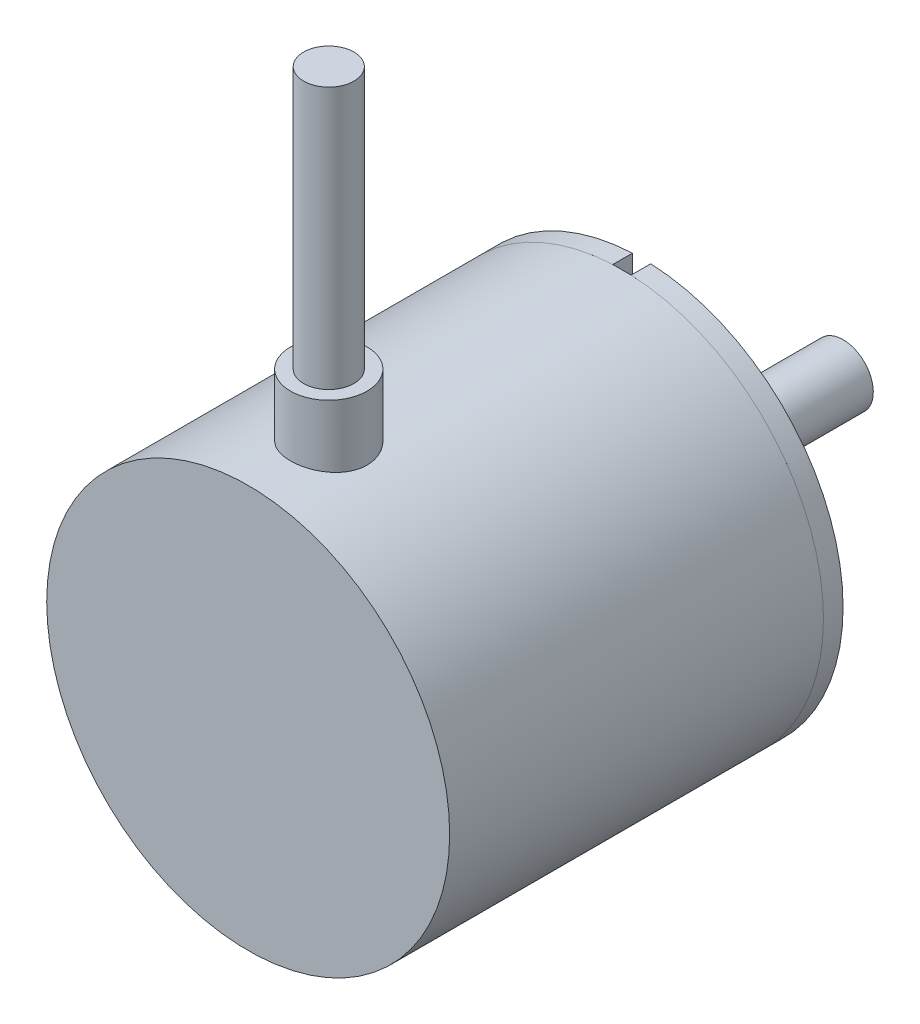
ISO-10303-21;
HEADER;
FILE_DESCRIPTION(('STEP AP214'),'2;1');
FILE_NAME('part.step','',(''),(''),'','','');
FILE_SCHEMA(('AUTOMOTIVE_DESIGN { 1 0 10303 214 1 1 1 1 }'));
ENDSEC;
DATA;
#1=APPLICATION_CONTEXT('core data for automotive mechanical design processes');
#2=APPLICATION_PROTOCOL_DEFINITION('international standard','automotive_design',2000,#1);
#3=PRODUCT_CONTEXT('',#1,'mechanical');
#4=PRODUCT('Part','Part','',(#3));
#5=PRODUCT_RELATED_PRODUCT_CATEGORY('part','',(#4));
#6=PRODUCT_DEFINITION_FORMATION('','',#4);
#7=PRODUCT_DEFINITION_CONTEXT('part definition',#1,'design');
#8=PRODUCT_DEFINITION('design','',#6,#7);
#9=PRODUCT_DEFINITION_SHAPE('','',#8);
#10=(LENGTH_UNIT() NAMED_UNIT(*) SI_UNIT(.MILLI.,.METRE.));
#11=(NAMED_UNIT(*) PLANE_ANGLE_UNIT() SI_UNIT($,.RADIAN.));
#12=(NAMED_UNIT(*) SI_UNIT($,.STERADIAN.) SOLID_ANGLE_UNIT());
#13=UNCERTAINTY_MEASURE_WITH_UNIT(LENGTH_MEASURE(1.E-05),#10,'distance_accuracy_value','');
#14=(GEOMETRIC_REPRESENTATION_CONTEXT(3) GLOBAL_UNCERTAINTY_ASSIGNED_CONTEXT((#13)) GLOBAL_UNIT_ASSIGNED_CONTEXT((#10,
#11,#12)) REPRESENTATION_CONTEXT('',''));
#15=CARTESIAN_POINT('',(0.,0.,0.));
#16=DIRECTION('',(0.,0.,1.));
#17=DIRECTION('',(1.,0.,0.));
#18=AXIS2_PLACEMENT_3D('',#15,#16,#17);
#19=CARTESIAN_POINT('',(0.,0.,0.));
#20=DIRECTION('',(0.,0.,1.));
#21=DIRECTION('',(1.,0.,0.));
#22=AXIS2_PLACEMENT_3D('',#19,#20,#21);
#23=PLANE('',#22);
#24=CARTESIAN_POINT('',(0.,0.,0.));
#25=DIRECTION('',(0.,0.,1.));
#26=DIRECTION('',(1.,0.,0.));
#27=AXIS2_PLACEMENT_3D('',#24,#25,#26);
#28=CIRCLE('',#27,10.);
#29=CARTESIAN_POINT('',(10.,0.,0.));
#30=VERTEX_POINT('',#29);
#31=EDGE_CURVE('E140',#30,#30,#28,.F.);
#32=ORIENTED_EDGE('',*,*,#31,.F.);
#33=EDGE_LOOP('',(#32));
#34=FACE_BOUND('',#33,.T.);
#35=CARTESIAN_POINT('',(0.,15.,0.));
#36=DIRECTION('',(0.,0.,-1.));
#37=DIRECTION('',(-1.,0.,0.));
#38=AXIS2_PLACEMENT_3D('',#35,#36,#37);
#39=CIRCLE('',#38,1.00000000000079);
#40=CARTESIAN_POINT('',(-1.00000000000079,15.,0.));
#41=VERTEX_POINT('',#40);
#42=EDGE_CURVE('E154',#41,#41,#39,.T.);
#43=ORIENTED_EDGE('',*,*,#42,.F.);
#44=EDGE_LOOP('',(#43));
#45=FACE_BOUND('',#44,.T.);
#46=CARTESIAN_POINT('',(-12.9903810567675,-7.49999999999947,0.));
#47=DIRECTION('',(0.,0.,-1.));
#48=DIRECTION('',(-1.,0.,0.));
#49=AXIS2_PLACEMENT_3D('',#46,#47,#48);
#50=CIRCLE('',#49,1.00000000000079);
#51=CARTESIAN_POINT('',(-13.9903810567683,-7.49999999999947,0.));
#52=VERTEX_POINT('',#51);
#53=EDGE_CURVE('E159',#52,#52,#50,.T.);
#54=ORIENTED_EDGE('',*,*,#53,.F.);
#55=EDGE_LOOP('',(#54));
#56=FACE_BOUND('',#55,.T.);
#57=CARTESIAN_POINT('',(12.9903810567657,-7.50000000000052,0.));
#58=DIRECTION('',(0.,0.,-1.));
#59=DIRECTION('',(-1.,0.,0.));
#60=AXIS2_PLACEMENT_3D('',#57,#58,#59);
#61=CIRCLE('',#60,1.00000000000079);
#62=CARTESIAN_POINT('',(11.9903810567649,-7.50000000000052,0.));
#63=VERTEX_POINT('',#62);
#64=EDGE_CURVE('E163',#63,#63,#61,.T.);
#65=ORIENTED_EDGE('',*,*,#64,.F.);
#66=EDGE_LOOP('',(#65));
#67=FACE_BOUND('',#66,.T.);
#68=DIRECTION('',(0.,-1.,0.));
#69=VECTOR('',#68,1.);
#70=CARTESIAN_POINT('',(-0.91,0.,0.));
#71=LINE('',#70,#69);
#72=CARTESIAN_POINT('',(-0.91,19.9792867740568,0.));
#73=VERTEX_POINT('',#72);
#74=CARTESIAN_POINT('',(-0.91,18.0794623505173,0.));
#75=VERTEX_POINT('',#74);
#76=EDGE_CURVE('E109',#73,#75,#71,.T.);
#77=ORIENTED_EDGE('',*,*,#76,.T.);
#78=DIRECTION('',(-1.,0.,0.));
#79=VECTOR('',#78,1.);
#80=CARTESIAN_POINT('',(0.,18.0794623505173,0.));
#81=LINE('',#80,#79);
#82=CARTESIAN_POINT('',(0.91,18.0794623505173,0.));
#83=VERTEX_POINT('',#82);
#84=EDGE_CURVE('E91',#83,#75,#81,.T.);
#85=ORIENTED_EDGE('',*,*,#84,.F.);
#86=DIRECTION('',(0.,-1.,0.));
#87=VECTOR('',#86,1.);
#88=CARTESIAN_POINT('',(0.91,0.,0.));
#89=LINE('',#88,#87);
#90=CARTESIAN_POINT('',(0.91,19.9792867740568,0.));
#91=VERTEX_POINT('',#90);
#92=EDGE_CURVE('E99',#91,#83,#89,.T.);
#93=ORIENTED_EDGE('',*,*,#92,.F.);
#94=CARTESIAN_POINT('',(0.,0.,0.));
#95=DIRECTION('',(0.,0.,1.));
#96=DIRECTION('',(1.,0.,0.));
#97=AXIS2_PLACEMENT_3D('',#94,#95,#96);
#98=CIRCLE('',#97,20.);
#99=EDGE_CURVE('E170',#73,#91,#98,.T.);
#100=ORIENTED_EDGE('',*,*,#99,.F.);
#101=EDGE_LOOP('',(#77,#85,#93,#100));
#102=FACE_BOUND('',#101,.T.);
#103=ADVANCED_FACE('F52',(#34,#45,#56,#67,#102),#23,.F.);
#104=CARTESIAN_POINT('',(0.,0.,1.95));
#105=DIRECTION('',(0.,0.,-1.));
#106=DIRECTION('',(-1.,0.,0.));
#107=AXIS2_PLACEMENT_3D('',#104,#105,#106);
#108=CYLINDRICAL_SURFACE('',#107,20.);
#109=DIRECTION('',(0.,0.,-1.));
#110=VECTOR('',#109,1.);
#111=CARTESIAN_POINT('',(-0.91,19.9792867740568,2.3));
#112=LINE('',#111,#110);
#113=CARTESIAN_POINT('',(-0.91,19.9792867740568,1.95));
#114=VERTEX_POINT('',#113);
#115=EDGE_CURVE('E121',#114,#73,#112,.T.);
#116=ORIENTED_EDGE('',*,*,#115,.T.);
#117=ORIENTED_EDGE('',*,*,#99,.T.);
#118=DIRECTION('',(0.,0.,-1.));
#119=VECTOR('',#118,1.);
#120=CARTESIAN_POINT('',(0.91,19.9792867740568,2.3));
#121=LINE('',#120,#119);
#122=CARTESIAN_POINT('',(0.91,19.9792867740568,1.95));
#123=VERTEX_POINT('',#122);
#124=EDGE_CURVE('E102',#123,#91,#121,.T.);
#125=ORIENTED_EDGE('',*,*,#124,.F.);
#126=CARTESIAN_POINT('',(0.,0.,1.95));
#127=DIRECTION('',(0.,0.,1.));
#128=DIRECTION('',(1.,0.,0.));
#129=AXIS2_PLACEMENT_3D('',#126,#127,#128);
#130=CIRCLE('',#129,20.);
#131=EDGE_CURVE('E141',#114,#123,#130,.T.);
#132=ORIENTED_EDGE('',*,*,#131,.F.);
#133=EDGE_LOOP('',(#116,#117,#125,#132));
#134=FACE_BOUND('',#133,.T.);
#135=ADVANCED_FACE('F192',(#134),#108,.T.);
#136=CARTESIAN_POINT('',(0.,0.,1.95));
#137=DIRECTION('',(0.,0.,1.));
#138=DIRECTION('',(1.,0.,0.));
#139=AXIS2_PLACEMENT_3D('',#136,#137,#138);
#140=PLANE('',#139);
#141=CARTESIAN_POINT('',(0.,15.,1.95));
#142=DIRECTION('',(0.,0.,1.));
#143=DIRECTION('',(1.,0.,0.));
#144=AXIS2_PLACEMENT_3D('',#141,#142,#143);
#145=CIRCLE('',#144,1.00000000000079);
#146=CARTESIAN_POINT('',(1.00000000000079,15.,1.95));
#147=VERTEX_POINT('',#146);
#148=EDGE_CURVE('E146',#147,#147,#145,.T.);
#149=ORIENTED_EDGE('',*,*,#148,.F.);
#150=EDGE_LOOP('',(#149));
#151=FACE_BOUND('',#150,.T.);
#152=CARTESIAN_POINT('',(-12.9903810567675,-7.49999999999947,1.95));
#153=DIRECTION('',(0.,0.,1.));
#154=DIRECTION('',(1.,0.,0.));
#155=AXIS2_PLACEMENT_3D('',#152,#153,#154);
#156=CIRCLE('',#155,1.00000000000079);
#157=CARTESIAN_POINT('',(-11.9903810567667,-7.49999999999947,1.95));
#158=VERTEX_POINT('',#157);
#159=EDGE_CURVE('E158',#158,#158,#156,.T.);
#160=ORIENTED_EDGE('',*,*,#159,.F.);
#161=EDGE_LOOP('',(#160));
#162=FACE_BOUND('',#161,.T.);
#163=CARTESIAN_POINT('',(12.9903810567657,-7.50000000000052,1.95));
#164=DIRECTION('',(0.,0.,1.));
#165=DIRECTION('',(1.,0.,0.));
#166=AXIS2_PLACEMENT_3D('',#163,#164,#165);
#167=CIRCLE('',#166,1.00000000000079);
#168=CARTESIAN_POINT('',(13.9903810567665,-7.50000000000052,1.95));
#169=VERTEX_POINT('',#168);
#170=EDGE_CURVE('E162',#169,#169,#167,.T.);
#171=ORIENTED_EDGE('',*,*,#170,.F.);
#172=EDGE_LOOP('',(#171));
#173=FACE_BOUND('',#172,.T.);
#174=DIRECTION('',(1.,0.,0.));
#175=VECTOR('',#174,1.);
#176=CARTESIAN_POINT('',(0.,18.0794623505173,1.95));
#177=LINE('',#176,#175);
#178=CARTESIAN_POINT('',(-0.91,18.0794623505173,1.95));
#179=VERTEX_POINT('',#178);
#180=CARTESIAN_POINT('',(0.91,18.0794623505173,1.95));
#181=VERTEX_POINT('',#180);
#182=EDGE_CURVE('E94',#179,#181,#177,.T.);
#183=ORIENTED_EDGE('',*,*,#182,.F.);
#184=DIRECTION('',(0.,1.,0.));
#185=VECTOR('',#184,1.);
#186=CARTESIAN_POINT('',(-0.91,0.,1.95));
#187=LINE('',#186,#185);
#188=EDGE_CURVE('E150',#179,#114,#187,.T.);
#189=ORIENTED_EDGE('',*,*,#188,.T.);
#190=ORIENTED_EDGE('',*,*,#131,.T.);
#191=DIRECTION('',(0.,1.,0.));
#192=VECTOR('',#191,1.);
#193=CARTESIAN_POINT('',(0.91,0.,1.95));
#194=LINE('',#193,#192);
#195=EDGE_CURVE('E111',#181,#123,#194,.T.);
#196=ORIENTED_EDGE('',*,*,#195,.F.);
#197=EDGE_LOOP('',(#183,#189,#190,#196));
#198=FACE_BOUND('',#197,.T.);
#199=ADVANCED_FACE('F133',(#151,#162,#173,#198),#140,.T.);
#200=CARTESIAN_POINT('',(0.,0.,-5.));
#201=DIRECTION('',(0.,0.,-1.));
#202=DIRECTION('',(-1.,0.,0.));
#203=AXIS2_PLACEMENT_3D('',#200,#201,#202);
#204=PLANE('',#203);
#205=CARTESIAN_POINT('',(0.,0.,-5.));
#206=DIRECTION('',(0.,0.,-1.));
#207=DIRECTION('',(-1.,0.,0.));
#208=AXIS2_PLACEMENT_3D('',#205,#206,#207);
#209=CIRCLE('',#208,7.5);
#210=CARTESIAN_POINT('',(-7.5,0.,-5.));
#211=VERTEX_POINT('',#210);
#212=EDGE_CURVE('E62',#211,#211,#209,.T.);
#213=ORIENTED_EDGE('',*,*,#212,.F.);
#214=EDGE_LOOP('',(#213));
#215=FACE_BOUND('',#214,.T.);
#216=CARTESIAN_POINT('',(0.,0.,-5.));
#217=DIRECTION('',(0.,0.,-1.));
#218=DIRECTION('',(-1.,0.,0.));
#219=AXIS2_PLACEMENT_3D('',#216,#217,#218);
#220=CIRCLE('',#219,10.);
#221=CARTESIAN_POINT('',(-10.,0.,-5.));
#222=VERTEX_POINT('',#221);
#223=EDGE_CURVE('E137',#222,#222,#220,.T.);
#224=ORIENTED_EDGE('',*,*,#223,.T.);
#225=EDGE_LOOP('',(#224));
#226=FACE_BOUND('',#225,.T.);
#227=ADVANCED_FACE('F129',(#215,#226),#204,.T.);
#228=CARTESIAN_POINT('',(0.,0.,-5.));
#229=DIRECTION('',(0.,0.,1.));
#230=DIRECTION('',(1.,0.,0.));
#231=AXIS2_PLACEMENT_3D('',#228,#229,#230);
#232=CYLINDRICAL_SURFACE('',#231,10.);
#233=ORIENTED_EDGE('',*,*,#223,.F.);
#234=EDGE_LOOP('',(#233));
#235=FACE_BOUND('',#234,.T.);
#236=ORIENTED_EDGE('',*,*,#31,.T.);
#237=EDGE_LOOP('',(#236));
#238=FACE_BOUND('',#237,.T.);
#239=ADVANCED_FACE('F132',(#235,#238),#232,.T.);
#240=CARTESIAN_POINT('',(0.,15.,10.));
#241=DIRECTION('',(0.,0.,-1.));
#242=DIRECTION('',(-1.,0.,0.));
#243=AXIS2_PLACEMENT_3D('',#240,#241,#242);
#244=CYLINDRICAL_SURFACE('',#243,1.00000000000079);
#245=ORIENTED_EDGE('',*,*,#148,.T.);
#246=EDGE_LOOP('',(#245));
#247=FACE_BOUND('',#246,.T.);
#248=ORIENTED_EDGE('',*,*,#42,.T.);
#249=EDGE_LOOP('',(#248));
#250=FACE_BOUND('',#249,.T.);
#251=ADVANCED_FACE('F205',(#247,#250),#244,.F.);
#252=CARTESIAN_POINT('',(-12.9903810567675,-7.49999999999947,10.));
#253=DIRECTION('',(0.,0.,-1.));
#254=DIRECTION('',(-1.,0.,0.));
#255=AXIS2_PLACEMENT_3D('',#252,#253,#254);
#256=CYLINDRICAL_SURFACE('',#255,1.00000000000079);
#257=ORIENTED_EDGE('',*,*,#159,.T.);
#258=EDGE_LOOP('',(#257));
#259=FACE_BOUND('',#258,.T.);
#260=ORIENTED_EDGE('',*,*,#53,.T.);
#261=EDGE_LOOP('',(#260));
#262=FACE_BOUND('',#261,.T.);
#263=ADVANCED_FACE('F209',(#259,#262),#256,.F.);
#264=CARTESIAN_POINT('',(12.9903810567657,-7.50000000000052,10.));
#265=DIRECTION('',(0.,0.,-1.));
#266=DIRECTION('',(-1.,0.,0.));
#267=AXIS2_PLACEMENT_3D('',#264,#265,#266);
#268=CYLINDRICAL_SURFACE('',#267,1.00000000000079);
#269=ORIENTED_EDGE('',*,*,#170,.T.);
#270=EDGE_LOOP('',(#269));
#271=FACE_BOUND('',#270,.T.);
#272=ORIENTED_EDGE('',*,*,#64,.T.);
#273=EDGE_LOOP('',(#272));
#274=FACE_BOUND('',#273,.T.);
#275=ADVANCED_FACE('F213',(#271,#274),#268,.F.);
#276=CARTESIAN_POINT('',(-0.91,0.,2.3));
#277=DIRECTION('',(1.,0.,0.));
#278=DIRECTION('',(0.,0.,-1.));
#279=AXIS2_PLACEMENT_3D('',#276,#277,#278);
#280=PLANE('',#279);
#281=DIRECTION('',(0.,0.,-1.));
#282=VECTOR('',#281,1.);
#283=CARTESIAN_POINT('',(-0.91,18.0794623505173,2.3));
#284=LINE('',#283,#282);
#285=EDGE_CURVE('E118',#179,#75,#284,.T.);
#286=ORIENTED_EDGE('',*,*,#285,.T.);
#287=ORIENTED_EDGE('',*,*,#76,.F.);
#288=ORIENTED_EDGE('',*,*,#115,.F.);
#289=ORIENTED_EDGE('',*,*,#188,.F.);
#290=EDGE_LOOP('',(#286,#287,#288,#289));
#291=FACE_BOUND('',#290,.T.);
#292=ADVANCED_FACE('F191',(#291),#280,.T.);
#293=CARTESIAN_POINT('',(0.,18.0794623505173,2.3));
#294=DIRECTION('',(0.,-1.,0.));
#295=DIRECTION('',(0.,0.,-1.));
#296=AXIS2_PLACEMENT_3D('',#293,#294,#295);
#297=PLANE('',#296);
#298=ORIENTED_EDGE('',*,*,#182,.T.);
#299=DIRECTION('',(0.,0.,-1.));
#300=VECTOR('',#299,1.);
#301=CARTESIAN_POINT('',(0.91,18.0794623505173,2.3));
#302=LINE('',#301,#300);
#303=EDGE_CURVE('E70',#181,#83,#302,.T.);
#304=ORIENTED_EDGE('',*,*,#303,.T.);
#305=ORIENTED_EDGE('',*,*,#84,.T.);
#306=ORIENTED_EDGE('',*,*,#285,.F.);
#307=EDGE_LOOP('',(#298,#304,#305,#306));
#308=FACE_BOUND('',#307,.T.);
#309=ADVANCED_FACE('F88',(#308),#297,.F.);
#310=CARTESIAN_POINT('',(0.91,0.,2.3));
#311=DIRECTION('',(1.,0.,0.));
#312=DIRECTION('',(0.,0.,-1.));
#313=AXIS2_PLACEMENT_3D('',#310,#311,#312);
#314=PLANE('',#313);
#315=ORIENTED_EDGE('',*,*,#195,.T.);
#316=ORIENTED_EDGE('',*,*,#124,.T.);
#317=ORIENTED_EDGE('',*,*,#92,.T.);
#318=ORIENTED_EDGE('',*,*,#303,.F.);
#319=EDGE_LOOP('',(#315,#316,#317,#318));
#320=FACE_BOUND('',#319,.T.);
#321=ADVANCED_FACE('F100',(#320),#314,.F.);
#322=CARTESIAN_POINT('',(0.,0.,-4.9));
#323=DIRECTION('',(0.,0.,-1.));
#324=DIRECTION('',(-1.,0.,0.));
#325=AXIS2_PLACEMENT_3D('',#322,#323,#324);
#326=CYLINDRICAL_SURFACE('',#325,7.5);
#327=CARTESIAN_POINT('',(0.,0.,-4.9));
#328=DIRECTION('',(0.,0.,-1.));
#329=DIRECTION('',(-1.,0.,0.));
#330=AXIS2_PLACEMENT_3D('',#327,#328,#329);
#331=CIRCLE('',#330,7.5);
#332=CARTESIAN_POINT('',(-7.5,0.,-4.9));
#333=VERTEX_POINT('',#332);
#334=EDGE_CURVE('E12',#333,#333,#331,.T.);
#335=ORIENTED_EDGE('',*,*,#334,.F.);
#336=EDGE_LOOP('',(#335));
#337=FACE_BOUND('',#336,.T.);
#338=ORIENTED_EDGE('',*,*,#212,.T.);
#339=EDGE_LOOP('',(#338));
#340=FACE_BOUND('',#339,.T.);
#341=ADVANCED_FACE('F127',(#337,#340),#326,.F.);
#342=CARTESIAN_POINT('',(0.,0.,-4.9));
#343=DIRECTION('',(0.,0.,-1.));
#344=DIRECTION('',(-1.,0.,0.));
#345=AXIS2_PLACEMENT_3D('',#342,#343,#344);
#346=PLANE('',#345);
#347=ORIENTED_EDGE('',*,*,#334,.T.);
#348=EDGE_LOOP('',(#347));
#349=FACE_BOUND('',#348,.T.);
#350=ADVANCED_FACE('F54',(#349),#346,.T.);
#351=CLOSED_SHELL('',(#103,#135,#199,#227,#239,#251,#263,#275,#292,#309,#321,#341,#350));
#352=MANIFOLD_SOLID_BREP('B2',#351);
#353=CARTESIAN_POINT('',(0.,26.,31.05));
#354=DIRECTION('',(0.,1.,0.));
#355=DIRECTION('',(0.,0.,1.));
#356=AXIS2_PLACEMENT_3D('',#353,#354,#355);
#357=PLANE('',#356);
#358=CARTESIAN_POINT('',(0.,26.,31.05));
#359=DIRECTION('',(0.,1.,0.));
#360=DIRECTION('',(0.,0.,1.));
#361=AXIS2_PLACEMENT_3D('',#358,#359,#360);
#362=CIRCLE('',#361,3.8);
#363=CARTESIAN_POINT('',(0.,26.,34.85));
#364=VERTEX_POINT('',#363);
#365=EDGE_CURVE('E386',#364,#364,#362,.T.);
#366=ORIENTED_EDGE('',*,*,#365,.T.);
#367=EDGE_LOOP('',(#366));
#368=FACE_BOUND('',#367,.T.);
#369=CARTESIAN_POINT('',(0.,26.,31.05));
#370=DIRECTION('',(0.,1.,0.));
#371=DIRECTION('',(0.,0.,1.));
#372=AXIS2_PLACEMENT_3D('',#369,#370,#371);
#373=CIRCLE('',#372,2.5);
#374=CARTESIAN_POINT('',(0.,26.,33.55));
#375=VERTEX_POINT('',#374);
#376=EDGE_CURVE('E392',#375,#375,#373,.T.);
#377=ORIENTED_EDGE('',*,*,#376,.F.);
#378=EDGE_LOOP('',(#377));
#379=FACE_BOUND('',#378,.T.);
#380=ADVANCED_FACE('F361',(#368,#379),#357,.T.);
#381=CARTESIAN_POINT('',(0.,0.,39.05));
#382=DIRECTION('',(0.,0.,-1.));
#383=DIRECTION('',(-1.,0.,0.));
#384=AXIS2_PLACEMENT_3D('',#381,#382,#383);
#385=CYLINDRICAL_SURFACE('',#384,20.);
#386=CARTESIAN_POINT('',(0.,0.,1.95));
#387=DIRECTION('',(0.,0.,1.));
#388=DIRECTION('',(1.,0.,0.));
#389=AXIS2_PLACEMENT_3D('',#386,#387,#388);
#390=CIRCLE('',#389,20.);
#391=CARTESIAN_POINT('',(20.,0.,1.95));
#392=VERTEX_POINT('',#391);
#393=EDGE_CURVE('E380',#392,#392,#390,.T.);
#394=ORIENTED_EDGE('',*,*,#393,.T.);
#395=EDGE_LOOP('',(#394));
#396=FACE_BOUND('',#395,.T.);
#397=CARTESIAN_POINT('',(0.,0.,39.05));
#398=DIRECTION('',(0.,0.,1.));
#399=DIRECTION('',(1.,0.,0.));
#400=AXIS2_PLACEMENT_3D('',#397,#398,#399);
#401=CIRCLE('',#400,20.);
#402=CARTESIAN_POINT('',(20.,0.,39.05));
#403=VERTEX_POINT('',#402);
#404=EDGE_CURVE('E374',#403,#403,#401,.T.);
#405=ORIENTED_EDGE('',*,*,#404,.F.);
#406=EDGE_LOOP('',(#405));
#407=FACE_BOUND('',#406,.T.);
#408=CARTESIAN_POINT('',(0.,20.,27.25));
#409=CARTESIAN_POINT('',(-0.211409170467327,19.9999961542323,27.2500080221101));
#410=CARTESIAN_POINT('',(-0.422922127898354,19.9966133928819,27.2677019195789));
#411=CARTESIAN_POINT('',(-0.839984159024682,19.9834449848688,27.3379623654532));
#412=CARTESIAN_POINT('',(-1.04552810753821,19.9736539963158,27.390558008419));
#413=CARTESIAN_POINT('',(-1.44456049920717,19.9487640007985,27.528950449601));
#414=CARTESIAN_POINT('',(-1.63805977200262,19.9336698456168,27.6147169075731));
#415=CARTESIAN_POINT('',(-2.00790510956374,19.8998203363427,27.8169294664745));
#416=CARTESIAN_POINT('',(-2.18425248934359,19.8810652632604,27.9333732128719));
#417=CARTESIAN_POINT('',(-2.51697105215255,19.8417053033425,28.195152721675));
#418=CARTESIAN_POINT('',(-2.67310113064527,19.8210823362121,28.3407922378417));
#419=CARTESIAN_POINT('',(-2.95886696734129,19.7804445961867,28.6561757865699));
#420=CARTESIAN_POINT('',(-3.08850079078569,19.7604298677961,28.8259215778409));
#421=CARTESIAN_POINT('',(-3.31860168020194,19.7230988451207,29.1864090605948));
#422=CARTESIAN_POINT('',(-3.41882262654874,19.705805853158,29.37731047713));
#423=CARTESIAN_POINT('',(-3.58567706988605,19.6761314285786,29.7736245855497));
#424=CARTESIAN_POINT('',(-3.6523135449711,19.6637495604899,29.9790359889224));
#425=CARTESIAN_POINT('',(-3.74933194374608,19.6454814650498,30.3959565887778));
#426=CARTESIAN_POINT('',(-3.78013484392349,19.6395198747464,30.607364455082));
#427=CARTESIAN_POINT('',(-3.80591857594181,19.634540186021,31.0324252533447));
#428=CARTESIAN_POINT('',(-3.80090270756635,19.6355214479927,31.2460779766861));
#429=CARTESIAN_POINT('',(-3.75553244831974,19.6442480072405,31.6665079036574));
#430=CARTESIAN_POINT('',(-3.71565751410713,19.6519015293418,31.8733390341715));
#431=CARTESIAN_POINT('',(-3.60245643623646,19.6729660265244,32.277321398546));
#432=CARTESIAN_POINT('',(-3.52912883658626,19.6863772522022,32.4744722106669));
#433=CARTESIAN_POINT('',(-3.35063720584687,19.7175415756265,32.8548962890743));
#434=CARTESIAN_POINT('',(-3.24528027247544,19.7353208526614,33.038076814078));
#435=CARTESIAN_POINT('',(-3.00585703473046,19.7732007899193,33.3843394509841));
#436=CARTESIAN_POINT('',(-2.87178774114429,19.7933016917437,33.5474194674571));
#437=CARTESIAN_POINT('',(-2.57616400040746,19.8339594539179,33.8516213185564));
#438=CARTESIAN_POINT('',(-2.41419962980204,19.8545184267878,33.9923448095286));
#439=CARTESIAN_POINT('',(-2.06875314340881,19.8934769245016,34.244684963348));
#440=CARTESIAN_POINT('',(-1.88527080077558,19.9118764265761,34.3563013193038));
#441=CARTESIAN_POINT('',(-1.50157598041669,19.9444815207307,34.5473204324655));
#442=CARTESIAN_POINT('',(-1.30134198123535,19.9586816081353,34.6266809586306));
#443=CARTESIAN_POINT('',(-0.890054959011917,19.9812455258448,34.7505286338464));
#444=CARTESIAN_POINT('',(-0.679003119317512,19.9896099930434,34.7950195885914));
#445=CARTESIAN_POINT('',(-0.255497719579876,19.9994725007416,34.8473088773612));
#446=CARTESIAN_POINT('',(-0.0431138328322673,20.0010726444528,34.855652875173));
#447=CARTESIAN_POINT('',(0.380014191672976,19.9975085572427,34.836876225767));
#448=CARTESIAN_POINT('',(0.590758411707601,19.9923446679653,34.8097573697398));
#449=CARTESIAN_POINT('',(1.00288830549625,19.975896378801,34.7212784196605));
#450=CARTESIAN_POINT('',(1.20433556626006,19.9646614874827,34.6601951873359));
#451=CARTESIAN_POINT('',(1.59412952640163,19.9373258457065,34.5058215920311));
#452=CARTESIAN_POINT('',(1.78247531674335,19.9212247580245,34.4125289969003));
#453=CARTESIAN_POINT('',(2.14304328890291,19.8856880666302,34.195182519842));
#454=CARTESIAN_POINT('',(2.31506151518706,19.8662171733405,34.0707961735566));
#455=CARTESIAN_POINT('',(2.63597913374777,19.8261901171718,33.7952420238678));
#456=CARTESIAN_POINT('',(2.78487630264077,19.8056338501746,33.6440716478284));
#457=CARTESIAN_POINT('',(3.05740496097472,19.765413070904,33.3167675589537));
#458=CARTESIAN_POINT('',(3.18066362671236,19.7457645712979,33.1403211179015));
#459=CARTESIAN_POINT('',(3.39579291791139,19.7099095371909,32.7689070607635));
#460=CARTESIAN_POINT('',(3.48766472876849,19.6937028727101,32.5739401445009));
#461=CARTESIAN_POINT('',(3.63688763834375,19.6666928737216,32.1719537976212));
#462=CARTESIAN_POINT('',(3.69440774330493,19.65586313059,31.9649989621616));
#463=CARTESIAN_POINT('',(3.77381405210164,19.6407736637121,31.5441366655658));
#464=CARTESIAN_POINT('',(3.79570439701343,19.6365131764557,31.3302300153537));
#465=CARTESIAN_POINT('',(3.80308834618145,19.6350840546938,30.9052722601002));
#466=CARTESIAN_POINT('',(3.78917023724654,19.6378007920638,30.694231539121));
#467=CARTESIAN_POINT('',(3.72662235451709,19.6497654576093,30.2775567264854));
#468=CARTESIAN_POINT('',(3.67799280145929,19.6590133442521,30.071922600456));
#469=CARTESIAN_POINT('',(3.5476534675359,19.682949445638,29.6722259316191));
#470=CARTESIAN_POINT('',(3.46600904087706,19.6976269074675,29.4781413916689));
#471=CARTESIAN_POINT('',(3.27202248901276,19.7307756869829,29.1063314638588));
#472=CARTESIAN_POINT('',(3.159678114922,19.7492472825785,28.9286072757309));
#473=CARTESIAN_POINT('',(2.90544249950504,19.7882578785796,28.5916195556383));
#474=CARTESIAN_POINT('',(2.76312375644477,19.8088242859378,28.4326816630379));
#475=CARTESIAN_POINT('',(2.45386904920005,19.849503793334,28.1407474229982));
#476=CARTESIAN_POINT('',(2.28692743807455,19.8696167881647,28.0077570425845));
#477=CARTESIAN_POINT('',(1.93130804184856,19.907342517305,27.7703371149878));
#478=CARTESIAN_POINT('',(1.74244286895555,19.9249303089506,27.6661841532342));
#479=CARTESIAN_POINT('',(1.34961886753758,19.955380052388,27.4912547671515));
#480=CARTESIAN_POINT('',(1.1456743110793,19.9682464057595,27.4204472388684));
#481=CARTESIAN_POINT('',(0.784297688068416,19.9852044773219,27.328466621649));
#482=CARTESIAN_POINT('',(0.628967830047845,19.9907212439867,27.2990923477028));
#483=CARTESIAN_POINT('',(0.315777906585669,19.9981203933227,27.2598563003173));
#484=CARTESIAN_POINT('',(0.157917908583858,20.0000028727022,27.2499940076637));
#485=CARTESIAN_POINT('',(0.,20.,27.25));
#486=B_SPLINE_CURVE_WITH_KNOTS('',3,(#408,#409,#410,#411,#412,#413,#414,#415,#416,#417,#418,
#419,#420,#421,#422,#423,#424,#425,#426,#427,#428,#429,#430,#431,#432,#433,#434,#435,#436,#437,
#438,#439,#440,#441,#442,#443,#444,#445,#446,#447,#448,#449,#450,#451,#452,#453,#454,#455,#456,
#457,#458,#459,#460,#461,#462,#463,#464,#465,#466,#467,#468,#469,#470,#471,#472,#473,#474,#475,
#476,#477,#478,#479,#480,#481,#482,#483,#484,#485),.UNSPECIFIED.,.T.,.F.,(4,2,2,2,2,2,2,2,2,2,2,
2,2,2,2,2,2,2,2,2,2,2,2,2,2,2,2,2,2,2,2,2,2,2,2,2,2,2,4),(0.,0.633649957641686,1.26782879901445,
1.901428944657,2.53498047461306,3.17550182400964,3.81606992763611,4.4618545644225,
5.10758192633874,5.74564406057233,6.38364741445397,7.01301124078936,7.64240246213848,
8.27566203182482,8.90898756155413,9.55256883556786,10.1961568949143,10.8405848804157,
11.4849425227049,12.1195384701565,12.7541023660826,13.3835678603608,14.0130769861719,
14.6496287228807,15.2862416342732,15.931548745728,16.5768314830023,17.2189127787949,
17.8609194432256,18.4924463579162,19.1239692566416,19.7542481040081,20.3845731340266,
21.0245839956356,21.6647418644649,22.3108422133651,22.9563386931751,23.4296735948471,
23.9029959008938),.UNSPECIFIED.);
#487=CARTESIAN_POINT('',(0.,20.,27.25));
#488=VERTEX_POINT('',#487);
#489=EDGE_CURVE('E51',#488,#488,#486,.T.);
#490=ORIENTED_EDGE('',*,*,#489,.F.);
#491=EDGE_LOOP('',(#490));
#492=FACE_BOUND('',#491,.T.);
#493=ADVANCED_FACE('F363',(#396,#407,#492),#385,.T.);
#494=CARTESIAN_POINT('',(0.,0.,39.05));
#495=DIRECTION('',(0.,0.,1.));
#496=DIRECTION('',(1.,0.,0.));
#497=AXIS2_PLACEMENT_3D('',#494,#495,#496);
#498=PLANE('',#497);
#499=ORIENTED_EDGE('',*,*,#404,.T.);
#500=EDGE_LOOP('',(#499));
#501=FACE_BOUND('',#500,.T.);
#502=ADVANCED_FACE('F414',(#501),#498,.T.);
#503=CARTESIAN_POINT('',(0.,0.,1.95));
#504=DIRECTION('',(0.,0.,1.));
#505=DIRECTION('',(1.,0.,0.));
#506=AXIS2_PLACEMENT_3D('',#503,#504,#505);
#507=PLANE('',#506);
#508=ORIENTED_EDGE('',*,*,#393,.F.);
#509=EDGE_LOOP('',(#508));
#510=FACE_BOUND('',#509,.T.);
#511=ADVANCED_FACE('F420',(#510),#507,.F.);
#512=CARTESIAN_POINT('',(0.,26.,31.05));
#513=DIRECTION('',(0.,-1.,0.));
#514=DIRECTION('',(0.,0.,-1.));
#515=AXIS2_PLACEMENT_3D('',#512,#513,#514);
#516=CYLINDRICAL_SURFACE('',#515,3.8);
#517=ORIENTED_EDGE('',*,*,#365,.F.);
#518=EDGE_LOOP('',(#517));
#519=FACE_BOUND('',#518,.T.);
#520=ORIENTED_EDGE('',*,*,#489,.T.);
#521=EDGE_LOOP('',(#520));
#522=FACE_BOUND('',#521,.T.);
#523=ADVANCED_FACE('F404',(#519,#522),#516,.T.);
#524=CARTESIAN_POINT('',(0.,52.,31.05));
#525=DIRECTION('',(0.,-1.,0.));
#526=DIRECTION('',(0.,0.,-1.));
#527=AXIS2_PLACEMENT_3D('',#524,#525,#526);
#528=CYLINDRICAL_SURFACE('',#527,2.5);
#529=CARTESIAN_POINT('',(0.,52.,31.05));
#530=DIRECTION('',(0.,1.,0.));
#531=DIRECTION('',(0.,0.,1.));
#532=AXIS2_PLACEMENT_3D('',#529,#530,#531);
#533=CIRCLE('',#532,2.5);
#534=CARTESIAN_POINT('',(0.,52.,33.55));
#535=VERTEX_POINT('',#534);
#536=EDGE_CURVE('E391',#535,#535,#533,.T.);
#537=ORIENTED_EDGE('',*,*,#536,.F.);
#538=EDGE_LOOP('',(#537));
#539=FACE_BOUND('',#538,.T.);
#540=ORIENTED_EDGE('',*,*,#376,.T.);
#541=EDGE_LOOP('',(#540));
#542=FACE_BOUND('',#541,.T.);
#543=ADVANCED_FACE('F401',(#539,#542),#528,.T.);
#544=CARTESIAN_POINT('',(0.,52.,31.05));
#545=DIRECTION('',(0.,1.,0.));
#546=DIRECTION('',(0.,0.,1.));
#547=AXIS2_PLACEMENT_3D('',#544,#545,#546);
#548=PLANE('',#547);
#549=ORIENTED_EDGE('',*,*,#536,.T.);
#550=EDGE_LOOP('',(#549));
#551=FACE_BOUND('',#550,.T.);
#552=ADVANCED_FACE('F399',(#551),#548,.T.);
#553=CLOSED_SHELL('',(#380,#493,#502,#511,#523,#543,#552));
#554=MANIFOLD_SOLID_BREP('B6',#553);
#555=CARTESIAN_POINT('',(0.,0.,-20.));
#556=DIRECTION('',(0.,0.,-1.));
#557=DIRECTION('',(-1.,0.,0.));
#558=AXIS2_PLACEMENT_3D('',#555,#556,#557);
#559=PLANE('',#558);
#560=DIRECTION('',(1.,0.,0.));
#561=VECTOR('',#560,1.);
#562=CARTESIAN_POINT('',(2.92743788288171,-2.,-20.));
#563=LINE('',#562,#561);
#564=CARTESIAN_POINT('',(-2.23606797749979,-2.,-20.));
#565=VERTEX_POINT('',#564);
#566=CARTESIAN_POINT('',(2.23606797749979,-2.,-20.));
#567=VERTEX_POINT('',#566);
#568=EDGE_CURVE('E507',#565,#567,#563,.T.);
#569=ORIENTED_EDGE('',*,*,#568,.F.);
#570=CARTESIAN_POINT('',(0.,0.,-20.));
#571=DIRECTION('',(0.,0.,-1.));
#572=DIRECTION('',(-1.,0.,0.));
#573=AXIS2_PLACEMENT_3D('',#570,#571,#572);
#574=CIRCLE('',#573,3.);
#575=EDGE_CURVE('E513',#565,#567,#574,.T.);
#576=ORIENTED_EDGE('',*,*,#575,.T.);
#577=EDGE_LOOP('',(#569,#576));
#578=FACE_BOUND('',#577,.T.);
#579=ADVANCED_FACE('F480',(#578),#559,.T.);
#580=CARTESIAN_POINT('',(0.,0.,-20.));
#581=DIRECTION('',(0.,0.,1.));
#582=DIRECTION('',(1.,0.,0.));
#583=AXIS2_PLACEMENT_3D('',#580,#581,#582);
#584=CYLINDRICAL_SURFACE('',#583,3.);
#585=ORIENTED_EDGE('',*,*,#575,.F.);
#586=DIRECTION('',(0.,0.,1.));
#587=VECTOR('',#586,1.);
#588=CARTESIAN_POINT('',(-2.23606797749979,-2.,-20.));
#589=LINE('',#588,#587);
#590=CARTESIAN_POINT('',(-2.23606797749979,-2.,-11.));
#591=VERTEX_POINT('',#590);
#592=EDGE_CURVE('E359',#565,#591,#589,.T.);
#593=ORIENTED_EDGE('',*,*,#592,.T.);
#594=CARTESIAN_POINT('',(0.,0.,-11.));
#595=DIRECTION('',(0.,0.,1.));
#596=DIRECTION('',(1.,0.,0.));
#597=AXIS2_PLACEMENT_3D('',#594,#595,#596);
#598=CIRCLE('',#597,3.);
#599=CARTESIAN_POINT('',(2.23606797749979,-2.,-11.));
#600=VERTEX_POINT('',#599);
#601=EDGE_CURVE('E498',#591,#600,#598,.T.);
#602=ORIENTED_EDGE('',*,*,#601,.T.);
#603=DIRECTION('',(0.,0.,1.));
#604=VECTOR('',#603,1.);
#605=CARTESIAN_POINT('',(2.23606797749979,-2.,-20.));
#606=LINE('',#605,#604);
#607=EDGE_CURVE('E488',#600,#567,#606,.F.);
#608=ORIENTED_EDGE('',*,*,#607,.T.);
#609=EDGE_LOOP('',(#585,#593,#602,#608));
#610=FACE_BOUND('',#609,.T.);
#611=CARTESIAN_POINT('',(0.,0.,-5.));
#612=DIRECTION('',(0.,0.,-1.));
#613=DIRECTION('',(-1.,0.,0.));
#614=AXIS2_PLACEMENT_3D('',#611,#612,#613);
#615=CIRCLE('',#614,3.);
#616=CARTESIAN_POINT('',(-3.,0.,-5.));
#617=VERTEX_POINT('',#616);
#618=EDGE_CURVE('E517',#617,#617,#615,.T.);
#619=ORIENTED_EDGE('',*,*,#618,.T.);
#620=EDGE_LOOP('',(#619));
#621=FACE_BOUND('',#620,.T.);
#622=ADVANCED_FACE('F482',(#610,#621),#584,.T.);
#623=CARTESIAN_POINT('',(0.,0.,-5.));
#624=DIRECTION('',(0.,0.,-1.));
#625=DIRECTION('',(-1.,0.,0.));
#626=AXIS2_PLACEMENT_3D('',#623,#624,#625);
#627=PLANE('',#626);
#628=ORIENTED_EDGE('',*,*,#618,.F.);
#629=EDGE_LOOP('',(#628));
#630=FACE_BOUND('',#629,.T.);
#631=ADVANCED_FACE('F526',(#630),#627,.F.);
#632=CARTESIAN_POINT('',(2.92743788288171,-2.,-11.));
#633=DIRECTION('',(0.,1.,0.));
#634=DIRECTION('',(0.,0.,1.));
#635=AXIS2_PLACEMENT_3D('',#632,#633,#634);
#636=PLANE('',#635);
#637=ORIENTED_EDGE('',*,*,#568,.T.);
#638=ORIENTED_EDGE('',*,*,#607,.F.);
#639=DIRECTION('',(1.,0.,0.));
#640=VECTOR('',#639,1.);
#641=CARTESIAN_POINT('',(2.92743788288171,-2.,-11.));
#642=LINE('',#641,#640);
#643=EDGE_CURVE('E494',#591,#600,#642,.T.);
#644=ORIENTED_EDGE('',*,*,#643,.F.);
#645=ORIENTED_EDGE('',*,*,#592,.F.);
#646=EDGE_LOOP('',(#637,#638,#644,#645));
#647=FACE_BOUND('',#646,.T.);
#648=ADVANCED_FACE('F506',(#647),#636,.F.);
#649=CARTESIAN_POINT('',(0.,0.,-11.));
#650=DIRECTION('',(0.,0.,1.));
#651=DIRECTION('',(1.,0.,0.));
#652=AXIS2_PLACEMENT_3D('',#649,#650,#651);
#653=PLANE('',#652);
#654=ORIENTED_EDGE('',*,*,#643,.T.);
#655=ORIENTED_EDGE('',*,*,#601,.F.);
#656=EDGE_LOOP('',(#654,#655));
#657=FACE_BOUND('',#656,.T.);
#658=ADVANCED_FACE('F533',(#657),#653,.F.);
#659=CLOSED_SHELL('',(#579,#622,#631,#648,#658));
#660=MANIFOLD_SOLID_BREP('B46',#659);
#661=ADVANCED_BREP_SHAPE_REPRESENTATION('',(#18,#352,#554,#660),#14);
#662=SHAPE_DEFINITION_REPRESENTATION(#9,#661);
ENDSEC;
END-ISO-10303-21;
